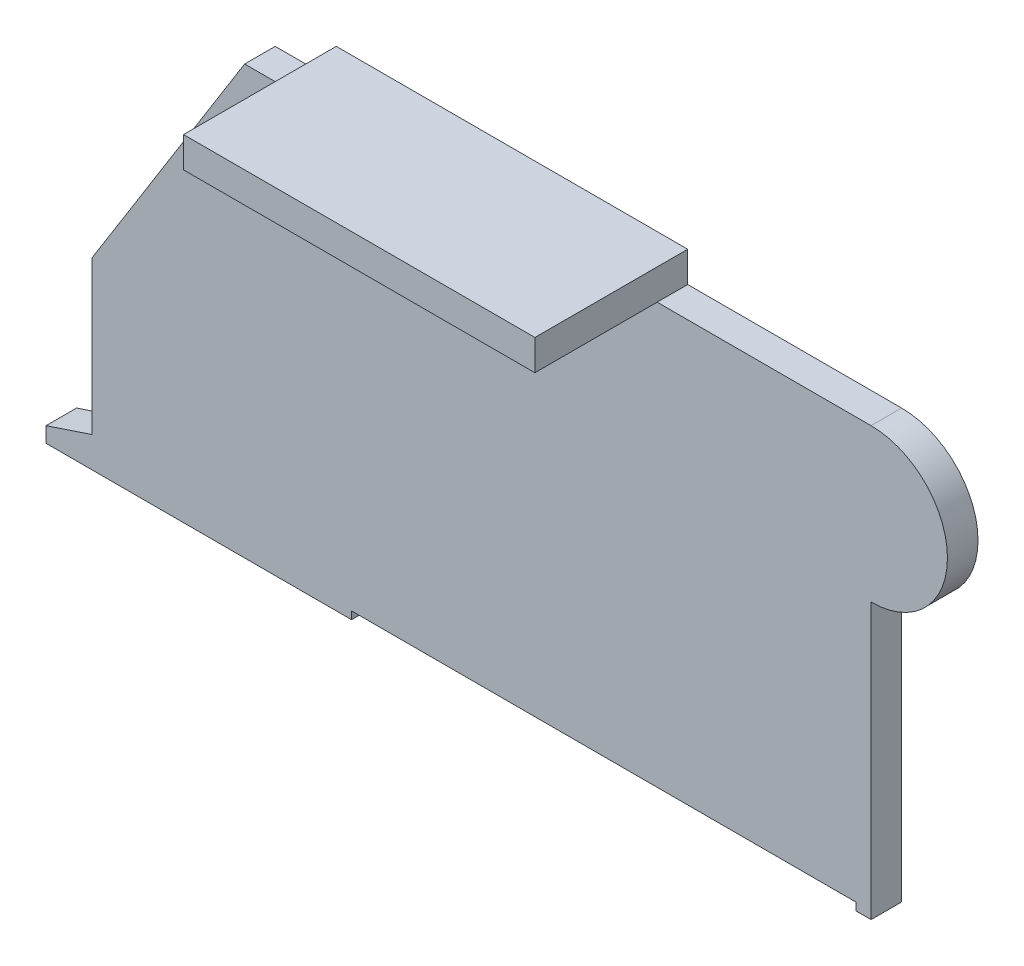
ISO-10303-21;
HEADER;
FILE_DESCRIPTION(('STEP AP214'),'2;1');
FILE_NAME('part.step','',(''),(''),'','','');
FILE_SCHEMA(('AUTOMOTIVE_DESIGN { 1 0 10303 214 1 1 1 1 }'));
ENDSEC;
DATA;
#1=APPLICATION_CONTEXT('core data for automotive mechanical design processes');
#2=APPLICATION_PROTOCOL_DEFINITION('international standard','automotive_design',2000,#1);
#3=PRODUCT_CONTEXT('',#1,'mechanical');
#4=PRODUCT('Part','Part','',(#3));
#5=PRODUCT_RELATED_PRODUCT_CATEGORY('part','',(#4));
#6=PRODUCT_DEFINITION_FORMATION('','',#4);
#7=PRODUCT_DEFINITION_CONTEXT('part definition',#1,'design');
#8=PRODUCT_DEFINITION('design','',#6,#7);
#9=PRODUCT_DEFINITION_SHAPE('','',#8);
#10=(LENGTH_UNIT() NAMED_UNIT(*) SI_UNIT(.MILLI.,.METRE.));
#11=(NAMED_UNIT(*) PLANE_ANGLE_UNIT() SI_UNIT($,.RADIAN.));
#12=(NAMED_UNIT(*) SI_UNIT($,.STERADIAN.) SOLID_ANGLE_UNIT());
#13=UNCERTAINTY_MEASURE_WITH_UNIT(LENGTH_MEASURE(1.E-05),#10,'distance_accuracy_value','');
#14=(GEOMETRIC_REPRESENTATION_CONTEXT(3) GLOBAL_UNCERTAINTY_ASSIGNED_CONTEXT((#13)) GLOBAL_UNIT_ASSIGNED_CONTEXT((#10,
#11,#12)) REPRESENTATION_CONTEXT('',''));
#15=CARTESIAN_POINT('',(0.,0.,0.));
#16=DIRECTION('',(0.,0.,1.));
#17=DIRECTION('',(1.,0.,0.));
#18=AXIS2_PLACEMENT_3D('',#15,#16,#17);
#19=CARTESIAN_POINT('',(0.,0.,2.));
#20=DIRECTION('',(0.,-1.,0.));
#21=DIRECTION('',(0.,0.,1.));
#22=AXIS2_PLACEMENT_3D('',#19,#20,#21);
#23=PLANE('',#22);
#24=DIRECTION('',(1.,0.,0.));
#25=VECTOR('',#24,1.);
#26=CARTESIAN_POINT('',(0.,0.,2.));
#27=LINE('',#26,#25);
#28=CARTESIAN_POINT('',(0.,0.,2.));
#29=VERTEX_POINT('',#28);
#30=CARTESIAN_POINT('',(20.,0.,2.));
#31=VERTEX_POINT('',#30);
#32=EDGE_CURVE('E286',#29,#31,#27,.T.);
#33=ORIENTED_EDGE('',*,*,#32,.F.);
#34=DIRECTION('',(0.,0.,-1.));
#35=VECTOR('',#34,1.);
#36=CARTESIAN_POINT('',(0.,0.,2.));
#37=LINE('',#36,#35);
#38=CARTESIAN_POINT('',(0.,0.,0.));
#39=VERTEX_POINT('',#38);
#40=EDGE_CURVE('E315',#29,#39,#37,.T.);
#41=ORIENTED_EDGE('',*,*,#40,.T.);
#42=DIRECTION('',(1.,0.,0.));
#43=VECTOR('',#42,1.);
#44=CARTESIAN_POINT('',(0.,0.,0.));
#45=LINE('',#44,#43);
#46=CARTESIAN_POINT('',(20.,0.,0.));
#47=VERTEX_POINT('',#46);
#48=EDGE_CURVE('E288',#39,#47,#45,.T.);
#49=ORIENTED_EDGE('',*,*,#48,.T.);
#50=DIRECTION('',(0.,0.,-1.));
#51=VECTOR('',#50,1.);
#52=CARTESIAN_POINT('',(20.,0.,0.5));
#53=LINE('',#52,#51);
#54=EDGE_CURVE('E272',#31,#47,#53,.T.);
#55=ORIENTED_EDGE('',*,*,#54,.F.);
#56=EDGE_LOOP('',(#33,#41,#49,#55));
#57=FACE_BOUND('',#56,.T.);
#58=ADVANCED_FACE('F41',(#57),#23,.T.);
#59=CARTESIAN_POINT('',(54.,28.,2.));
#60=DIRECTION('',(0.,1.,0.));
#61=DIRECTION('',(-1.,0.,0.));
#62=AXIS2_PLACEMENT_3D('',#59,#60,#61);
#63=PLANE('',#62);
#64=DIRECTION('',(-1.,0.,0.));
#65=VECTOR('',#64,1.);
#66=CARTESIAN_POINT('',(54.,28.,0.));
#67=LINE('',#66,#65);
#68=CARTESIAN_POINT('',(17.,28.,0.));
#69=VERTEX_POINT('',#68);
#70=CARTESIAN_POINT('',(13.,28.,0.));
#71=VERTEX_POINT('',#70);
#72=EDGE_CURVE('E325',#69,#71,#67,.T.);
#73=ORIENTED_EDGE('',*,*,#72,.T.);
#74=DIRECTION('',(0.,0.,-1.));
#75=VECTOR('',#74,1.);
#76=CARTESIAN_POINT('',(13.,28.,2.));
#77=LINE('',#76,#75);
#78=CARTESIAN_POINT('',(13.,28.,2.));
#79=VERTEX_POINT('',#78);
#80=EDGE_CURVE('E343',#79,#71,#77,.T.);
#81=ORIENTED_EDGE('',*,*,#80,.F.);
#82=DIRECTION('',(-1.,0.,0.));
#83=VECTOR('',#82,1.);
#84=CARTESIAN_POINT('',(54.,28.,2.));
#85=LINE('',#84,#83);
#86=CARTESIAN_POINT('',(17.,28.,2.));
#87=VERTEX_POINT('',#86);
#88=EDGE_CURVE('E305',#87,#79,#85,.T.);
#89=ORIENTED_EDGE('',*,*,#88,.F.);
#90=DIRECTION('',(0.,0.,-1.));
#91=VECTOR('',#90,1.);
#92=CARTESIAN_POINT('',(17.,28.,0.));
#93=LINE('',#92,#91);
#94=EDGE_CURVE('E461',#87,#69,#93,.T.);
#95=ORIENTED_EDGE('',*,*,#94,.T.);
#96=EDGE_LOOP('',(#73,#81,#89,#95));
#97=FACE_BOUND('',#96,.T.);
#98=ADVANCED_FACE('F555',(#97),#63,.T.);
#99=CARTESIAN_POINT('',(54.,28.,2.));
#100=VERTEX_POINT('',#99);
#101=CARTESIAN_POINT('',(40.,28.,2.));
#102=VERTEX_POINT('',#101);
#103=EDGE_CURVE('E306',#100,#102,#85,.T.);
#104=ORIENTED_EDGE('',*,*,#103,.F.);
#105=DIRECTION('',(0.,0.,-1.));
#106=VECTOR('',#105,1.);
#107=CARTESIAN_POINT('',(54.,28.,2.));
#108=LINE('',#107,#106);
#109=CARTESIAN_POINT('',(54.,28.,0.));
#110=VERTEX_POINT('',#109);
#111=EDGE_CURVE('E346',#100,#110,#108,.T.);
#112=ORIENTED_EDGE('',*,*,#111,.T.);
#113=CARTESIAN_POINT('',(40.,28.,0.));
#114=VERTEX_POINT('',#113);
#115=EDGE_CURVE('E326',#110,#114,#67,.T.);
#116=ORIENTED_EDGE('',*,*,#115,.T.);
#117=DIRECTION('',(0.,0.,1.));
#118=VECTOR('',#117,1.);
#119=CARTESIAN_POINT('',(40.,28.,0.));
#120=LINE('',#119,#118);
#121=EDGE_CURVE('E502',#114,#102,#120,.T.);
#122=ORIENTED_EDGE('',*,*,#121,.T.);
#123=EDGE_LOOP('',(#104,#112,#116,#122));
#124=FACE_BOUND('',#123,.T.);
#125=ADVANCED_FACE('F524',(#124),#63,.T.);
#126=CARTESIAN_POINT('',(0.,0.,2.));
#127=DIRECTION('',(-1.,0.,0.));
#128=DIRECTION('',(0.,0.,-1.));
#129=AXIS2_PLACEMENT_3D('',#126,#127,#128);
#130=PLANE('',#129);
#131=DIRECTION('',(0.,-1.,0.));
#132=VECTOR('',#131,1.);
#133=CARTESIAN_POINT('',(0.,0.,0.));
#134=LINE('',#133,#132);
#135=CARTESIAN_POINT('',(0.,1.,0.));
#136=VERTEX_POINT('',#135);
#137=EDGE_CURVE('E316',#136,#39,#134,.T.);
#138=ORIENTED_EDGE('',*,*,#137,.T.);
#139=ORIENTED_EDGE('',*,*,#40,.F.);
#140=DIRECTION('',(0.,-1.,0.));
#141=VECTOR('',#140,1.);
#142=CARTESIAN_POINT('',(0.,0.,2.));
#143=LINE('',#142,#141);
#144=CARTESIAN_POINT('',(0.,1.,2.));
#145=VERTEX_POINT('',#144);
#146=EDGE_CURVE('E294',#145,#29,#143,.T.);
#147=ORIENTED_EDGE('',*,*,#146,.F.);
#148=DIRECTION('',(0.,0.,-1.));
#149=VECTOR('',#148,1.);
#150=CARTESIAN_POINT('',(0.,1.,2.));
#151=LINE('',#150,#149);
#152=EDGE_CURVE('E49',#145,#136,#151,.T.);
#153=ORIENTED_EDGE('',*,*,#152,.T.);
#154=EDGE_LOOP('',(#138,#139,#147,#153));
#155=FACE_BOUND('',#154,.T.);
#156=ADVANCED_FACE('F43',(#155),#130,.T.);
#157=CARTESIAN_POINT('',(0.,1.,2.));
#158=DIRECTION('',(-0.316227766016838,0.948683298050514,0.));
#159=DIRECTION('',(-0.948683298050514,-0.316227766016838,0.));
#160=AXIS2_PLACEMENT_3D('',#157,#158,#159);
#161=PLANE('',#160);
#162=DIRECTION('',(-0.948683298050514,-0.316227766016838,0.));
#163=VECTOR('',#162,1.);
#164=CARTESIAN_POINT('',(0.,1.,0.));
#165=LINE('',#164,#163);
#166=CARTESIAN_POINT('',(3.,2.,0.));
#167=VERTEX_POINT('',#166);
#168=EDGE_CURVE('E333',#167,#136,#165,.T.);
#169=ORIENTED_EDGE('',*,*,#168,.T.);
#170=ORIENTED_EDGE('',*,*,#152,.F.);
#171=DIRECTION('',(-0.948683298050514,-0.316227766016838,0.));
#172=VECTOR('',#171,1.);
#173=CARTESIAN_POINT('',(0.,1.,2.));
#174=LINE('',#173,#172);
#175=CARTESIAN_POINT('',(3.,2.,2.));
#176=VERTEX_POINT('',#175);
#177=EDGE_CURVE('E313',#176,#145,#174,.T.);
#178=ORIENTED_EDGE('',*,*,#177,.F.);
#179=DIRECTION('',(0.,0.,-1.));
#180=VECTOR('',#179,1.);
#181=CARTESIAN_POINT('',(3.,2.,2.));
#182=LINE('',#181,#180);
#183=EDGE_CURVE('E337',#176,#167,#182,.T.);
#184=ORIENTED_EDGE('',*,*,#183,.T.);
#185=EDGE_LOOP('',(#169,#170,#178,#184));
#186=FACE_BOUND('',#185,.T.);
#187=ADVANCED_FACE('F566',(#186),#161,.T.);
#188=CARTESIAN_POINT('',(3.,2.,2.));
#189=DIRECTION('',(-1.,0.,0.));
#190=DIRECTION('',(0.,0.,-1.));
#191=AXIS2_PLACEMENT_3D('',#188,#189,#190);
#192=PLANE('',#191);
#193=DIRECTION('',(0.,-1.,0.));
#194=VECTOR('',#193,1.);
#195=CARTESIAN_POINT('',(3.,2.,0.));
#196=LINE('',#195,#194);
#197=CARTESIAN_POINT('',(3.,12.,0.));
#198=VERTEX_POINT('',#197);
#199=EDGE_CURVE('E331',#198,#167,#196,.T.);
#200=ORIENTED_EDGE('',*,*,#199,.T.);
#201=ORIENTED_EDGE('',*,*,#183,.F.);
#202=DIRECTION('',(0.,-1.,0.));
#203=VECTOR('',#202,1.);
#204=CARTESIAN_POINT('',(3.,2.,2.));
#205=LINE('',#204,#203);
#206=CARTESIAN_POINT('',(3.,12.,2.));
#207=VERTEX_POINT('',#206);
#208=EDGE_CURVE('E311',#207,#176,#205,.T.);
#209=ORIENTED_EDGE('',*,*,#208,.F.);
#210=DIRECTION('',(0.,0.,-1.));
#211=VECTOR('',#210,1.);
#212=CARTESIAN_POINT('',(3.,12.,2.));
#213=LINE('',#212,#211);
#214=EDGE_CURVE('E340',#207,#198,#213,.T.);
#215=ORIENTED_EDGE('',*,*,#214,.T.);
#216=EDGE_LOOP('',(#200,#201,#209,#215));
#217=FACE_BOUND('',#216,.T.);
#218=ADVANCED_FACE('F563',(#217),#192,.T.);
#219=CARTESIAN_POINT('',(3.,12.,2.));
#220=DIRECTION('',(-0.847998304005088,0.52999894000318,0.));
#221=DIRECTION('',(-0.52999894000318,-0.847998304005088,0.));
#222=AXIS2_PLACEMENT_3D('',#219,#220,#221);
#223=PLANE('',#222);
#224=DIRECTION('',(-0.52999894000318,-0.847998304005088,0.));
#225=VECTOR('',#224,1.);
#226=CARTESIAN_POINT('',(3.,12.,0.));
#227=LINE('',#226,#225);
#228=EDGE_CURVE('E329',#71,#198,#227,.T.);
#229=ORIENTED_EDGE('',*,*,#228,.T.);
#230=ORIENTED_EDGE('',*,*,#214,.F.);
#231=DIRECTION('',(-0.52999894000318,-0.847998304005088,0.));
#232=VECTOR('',#231,1.);
#233=CARTESIAN_POINT('',(3.,12.,2.));
#234=LINE('',#233,#232);
#235=EDGE_CURVE('E309',#79,#207,#234,.T.);
#236=ORIENTED_EDGE('',*,*,#235,.F.);
#237=ORIENTED_EDGE('',*,*,#80,.T.);
#238=EDGE_LOOP('',(#229,#230,#236,#237));
#239=FACE_BOUND('',#238,.T.);
#240=ADVANCED_FACE('F560',(#239),#223,.T.);
#241=CARTESIAN_POINT('',(54.,23.,2.));
#242=DIRECTION('',(0.,0.,-1.));
#243=DIRECTION('',(1.,0.,0.));
#244=AXIS2_PLACEMENT_3D('',#241,#242,#243);
#245=CYLINDRICAL_SURFACE('',#244,5.);
#246=CARTESIAN_POINT('',(54.,23.,0.));
#247=DIRECTION('',(0.,0.,1.));
#248=DIRECTION('',(1.,0.,0.));
#249=AXIS2_PLACEMENT_3D('',#246,#247,#248);
#250=CIRCLE('',#249,5.);
#251=CARTESIAN_POINT('',(54.,18.,0.));
#252=VERTEX_POINT('',#251);
#253=EDGE_CURVE('E323',#252,#110,#250,.T.);
#254=ORIENTED_EDGE('',*,*,#253,.T.);
#255=ORIENTED_EDGE('',*,*,#111,.F.);
#256=CARTESIAN_POINT('',(54.,23.,2.));
#257=DIRECTION('',(0.,0.,1.));
#258=DIRECTION('',(1.,0.,0.));
#259=AXIS2_PLACEMENT_3D('',#256,#257,#258);
#260=CIRCLE('',#259,5.);
#261=CARTESIAN_POINT('',(54.,18.,2.));
#262=VERTEX_POINT('',#261);
#263=EDGE_CURVE('E299',#262,#100,#260,.T.);
#264=ORIENTED_EDGE('',*,*,#263,.F.);
#265=DIRECTION('',(0.,0.,-1.));
#266=VECTOR('',#265,1.);
#267=CARTESIAN_POINT('',(54.,18.,2.));
#268=LINE('',#267,#266);
#269=EDGE_CURVE('E349',#262,#252,#268,.T.);
#270=ORIENTED_EDGE('',*,*,#269,.T.);
#271=EDGE_LOOP('',(#254,#255,#264,#270));
#272=FACE_BOUND('',#271,.T.);
#273=ADVANCED_FACE('F533',(#272),#245,.T.);
#274=CARTESIAN_POINT('',(54.,0.,2.));
#275=DIRECTION('',(1.,0.,0.));
#276=DIRECTION('',(0.,0.,1.));
#277=AXIS2_PLACEMENT_3D('',#274,#275,#276);
#278=PLANE('',#277);
#279=DIRECTION('',(0.,1.,0.));
#280=VECTOR('',#279,1.);
#281=CARTESIAN_POINT('',(54.,0.,0.));
#282=LINE('',#281,#280);
#283=CARTESIAN_POINT('',(54.,0.,0.));
#284=VERTEX_POINT('',#283);
#285=EDGE_CURVE('E321',#284,#252,#282,.T.);
#286=ORIENTED_EDGE('',*,*,#285,.T.);
#287=ORIENTED_EDGE('',*,*,#269,.F.);
#288=DIRECTION('',(0.,1.,0.));
#289=VECTOR('',#288,1.);
#290=CARTESIAN_POINT('',(54.,0.,2.));
#291=LINE('',#290,#289);
#292=CARTESIAN_POINT('',(54.,0.,2.));
#293=VERTEX_POINT('',#292);
#294=EDGE_CURVE('E296',#293,#262,#291,.T.);
#295=ORIENTED_EDGE('',*,*,#294,.F.);
#296=DIRECTION('',(0.,0.,-1.));
#297=VECTOR('',#296,1.);
#298=CARTESIAN_POINT('',(54.,0.,2.));
#299=LINE('',#298,#297);
#300=EDGE_CURVE('E352',#293,#284,#299,.T.);
#301=ORIENTED_EDGE('',*,*,#300,.T.);
#302=EDGE_LOOP('',(#286,#287,#295,#301));
#303=FACE_BOUND('',#302,.T.);
#304=ADVANCED_FACE('F583',(#303),#278,.T.);
#305=DIRECTION('',(0.,0.,-1.));
#306=VECTOR('',#305,1.);
#307=CARTESIAN_POINT('',(53.,0.,0.6));
#308=LINE('',#307,#306);
#309=CARTESIAN_POINT('',(53.,0.,2.));
#310=VERTEX_POINT('',#309);
#311=CARTESIAN_POINT('',(53.,0.,0.));
#312=VERTEX_POINT('',#311);
#313=EDGE_CURVE('E450',#310,#312,#308,.T.);
#314=ORIENTED_EDGE('',*,*,#313,.T.);
#315=EDGE_CURVE('E318',#312,#284,#45,.T.);
#316=ORIENTED_EDGE('',*,*,#315,.T.);
#317=ORIENTED_EDGE('',*,*,#300,.F.);
#318=EDGE_CURVE('E297',#310,#293,#27,.T.);
#319=ORIENTED_EDGE('',*,*,#318,.F.);
#320=EDGE_LOOP('',(#314,#316,#317,#319));
#321=FACE_BOUND('',#320,.T.);
#322=ADVANCED_FACE('F576',(#321),#23,.T.);
#323=CARTESIAN_POINT('',(54.,23.,2.));
#324=DIRECTION('',(0.,0.,-1.));
#325=DIRECTION('',(1.,0.,0.));
#326=AXIS2_PLACEMENT_3D('',#323,#324,#325);
#327=PLANE('',#326);
#328=DIRECTION('',(-1.,0.,0.));
#329=VECTOR('',#328,1.);
#330=CARTESIAN_POINT('',(54.,0.5,2.));
#331=LINE('',#330,#329);
#332=CARTESIAN_POINT('',(53.,0.5,2.));
#333=VERTEX_POINT('',#332);
#334=CARTESIAN_POINT('',(20.,0.5,2.));
#335=VERTEX_POINT('',#334);
#336=EDGE_CURVE('E281',#333,#335,#331,.T.);
#337=ORIENTED_EDGE('',*,*,#336,.F.);
#338=DIRECTION('',(0.,1.,0.));
#339=VECTOR('',#338,1.);
#340=CARTESIAN_POINT('',(53.0000000000003,23.,2.));
#341=LINE('',#340,#339);
#342=EDGE_CURVE('E280',#310,#333,#341,.T.);
#343=ORIENTED_EDGE('',*,*,#342,.F.);
#344=ORIENTED_EDGE('',*,*,#318,.T.);
#345=ORIENTED_EDGE('',*,*,#294,.T.);
#346=ORIENTED_EDGE('',*,*,#263,.T.);
#347=ORIENTED_EDGE('',*,*,#103,.T.);
#348=DIRECTION('',(1.,0.,0.));
#349=VECTOR('',#348,1.);
#350=CARTESIAN_POINT('',(54.,28.,2.));
#351=LINE('',#350,#349);
#352=EDGE_CURVE('E319',#87,#102,#351,.T.);
#353=ORIENTED_EDGE('',*,*,#352,.F.);
#354=ORIENTED_EDGE('',*,*,#88,.T.);
#355=ORIENTED_EDGE('',*,*,#235,.T.);
#356=ORIENTED_EDGE('',*,*,#208,.T.);
#357=ORIENTED_EDGE('',*,*,#177,.T.);
#358=ORIENTED_EDGE('',*,*,#146,.T.);
#359=ORIENTED_EDGE('',*,*,#32,.T.);
#360=DIRECTION('',(0.,-1.,0.));
#361=VECTOR('',#360,1.);
#362=CARTESIAN_POINT('',(20.,23.,2.));
#363=LINE('',#362,#361);
#364=EDGE_CURVE('E268',#335,#31,#363,.T.);
#365=ORIENTED_EDGE('',*,*,#364,.F.);
#366=EDGE_LOOP('',(#337,#343,#344,#345,#346,#347,#353,#354,#355,#356,#357,#358,#359,#365));
#367=FACE_BOUND('',#366,.T.);
#368=ADVANCED_FACE('F292',(#367),#327,.F.);
#369=CARTESIAN_POINT('',(54.,23.,0.));
#370=DIRECTION('',(0.,0.,-1.));
#371=DIRECTION('',(1.,0.,0.));
#372=AXIS2_PLACEMENT_3D('',#369,#370,#371);
#373=PLANE('',#372);
#374=DIRECTION('',(-1.,0.,0.));
#375=VECTOR('',#374,1.);
#376=CARTESIAN_POINT('',(20.,0.5,0.));
#377=LINE('',#376,#375);
#378=CARTESIAN_POINT('',(45.,0.5,0.));
#379=VERTEX_POINT('',#378);
#380=CARTESIAN_POINT('',(33.,0.5,0.));
#381=VERTEX_POINT('',#380);
#382=EDGE_CURVE('E966',#379,#381,#377,.T.);
#383=ORIENTED_EDGE('',*,*,#382,.T.);
#384=DIRECTION('',(0.,1.,0.));
#385=VECTOR('',#384,1.);
#386=CARTESIAN_POINT('',(33.,0.,0.));
#387=LINE('',#386,#385);
#388=CARTESIAN_POINT('',(33.,4.,0.));
#389=VERTEX_POINT('',#388);
#390=EDGE_CURVE('E418',#381,#389,#387,.T.);
#391=ORIENTED_EDGE('',*,*,#390,.T.);
#392=DIRECTION('',(-1.,0.,0.));
#393=VECTOR('',#392,1.);
#394=CARTESIAN_POINT('',(25.,4.,0.));
#395=LINE('',#394,#393);
#396=CARTESIAN_POINT('',(25.,4.,0.));
#397=VERTEX_POINT('',#396);
#398=EDGE_CURVE('E414',#389,#397,#395,.T.);
#399=ORIENTED_EDGE('',*,*,#398,.T.);
#400=DIRECTION('',(0.,-1.,0.));
#401=VECTOR('',#400,1.);
#402=CARTESIAN_POINT('',(25.,0.,0.));
#403=LINE('',#402,#401);
#404=CARTESIAN_POINT('',(25.,0.5,0.));
#405=VERTEX_POINT('',#404);
#406=EDGE_CURVE('E399',#397,#405,#403,.T.);
#407=ORIENTED_EDGE('',*,*,#406,.T.);
#408=CARTESIAN_POINT('',(24.,0.5,0.));
#409=VERTEX_POINT('',#408);
#410=EDGE_CURVE('E631',#405,#409,#377,.T.);
#411=ORIENTED_EDGE('',*,*,#410,.T.);
#412=DIRECTION('',(0.,1.,0.));
#413=VECTOR('',#412,1.);
#414=CARTESIAN_POINT('',(24.,0.,0.));
#415=LINE('',#414,#413);
#416=CARTESIAN_POINT('',(24.,10.,0.));
#417=VERTEX_POINT('',#416);
#418=EDGE_CURVE('E371',#409,#417,#415,.T.);
#419=ORIENTED_EDGE('',*,*,#418,.T.);
#420=DIRECTION('',(-1.,0.,0.));
#421=VECTOR('',#420,1.);
#422=CARTESIAN_POINT('',(24.,10.,0.));
#423=LINE('',#422,#421);
#424=CARTESIAN_POINT('',(20.,10.,0.));
#425=VERTEX_POINT('',#424);
#426=EDGE_CURVE('E365',#417,#425,#423,.T.);
#427=ORIENTED_EDGE('',*,*,#426,.T.);
#428=DIRECTION('',(0.,-1.,0.));
#429=VECTOR('',#428,1.);
#430=CARTESIAN_POINT('',(20.,0.,0.));
#431=LINE('',#430,#429);
#432=EDGE_CURVE('E363',#425,#47,#431,.T.);
#433=ORIENTED_EDGE('',*,*,#432,.T.);
#434=ORIENTED_EDGE('',*,*,#48,.F.);
#435=ORIENTED_EDGE('',*,*,#137,.F.);
#436=ORIENTED_EDGE('',*,*,#168,.F.);
#437=ORIENTED_EDGE('',*,*,#199,.F.);
#438=ORIENTED_EDGE('',*,*,#228,.F.);
#439=ORIENTED_EDGE('',*,*,#72,.F.);
#440=DIRECTION('',(0.,-1.,0.));
#441=VECTOR('',#440,1.);
#442=CARTESIAN_POINT('',(17.,30.,0.));
#443=LINE('',#442,#441);
#444=CARTESIAN_POINT('',(17.,30.,0.));
#445=VERTEX_POINT('',#444);
#446=EDGE_CURVE('E512',#445,#69,#443,.T.);
#447=ORIENTED_EDGE('',*,*,#446,.F.);
#448=DIRECTION('',(1.,0.,0.));
#449=VECTOR('',#448,1.);
#450=CARTESIAN_POINT('',(17.,30.,0.));
#451=LINE('',#450,#449);
#452=CARTESIAN_POINT('',(40.,30.,0.));
#453=VERTEX_POINT('',#452);
#454=EDGE_CURVE('E489',#445,#453,#451,.T.);
#455=ORIENTED_EDGE('',*,*,#454,.T.);
#456=DIRECTION('',(0.,-1.,0.));
#457=VECTOR('',#456,1.);
#458=CARTESIAN_POINT('',(40.,30.,0.));
#459=LINE('',#458,#457);
#460=EDGE_CURVE('E510',#453,#114,#459,.T.);
#461=ORIENTED_EDGE('',*,*,#460,.T.);
#462=ORIENTED_EDGE('',*,*,#115,.F.);
#463=ORIENTED_EDGE('',*,*,#253,.F.);
#464=ORIENTED_EDGE('',*,*,#285,.F.);
#465=ORIENTED_EDGE('',*,*,#315,.F.);
#466=DIRECTION('',(0.,1.,0.));
#467=VECTOR('',#466,1.);
#468=CARTESIAN_POINT('',(53.,0.,0.));
#469=LINE('',#468,#467);
#470=CARTESIAN_POINT('',(53.,4.,0.));
#471=VERTEX_POINT('',#470);
#472=EDGE_CURVE('E425',#312,#471,#469,.T.);
#473=ORIENTED_EDGE('',*,*,#472,.T.);
#474=DIRECTION('',(-1.,0.,0.));
#475=VECTOR('',#474,1.);
#476=CARTESIAN_POINT('',(45.,4.,0.));
#477=LINE('',#476,#475);
#478=CARTESIAN_POINT('',(45.,4.,0.));
#479=VERTEX_POINT('',#478);
#480=EDGE_CURVE('E428',#471,#479,#477,.T.);
#481=ORIENTED_EDGE('',*,*,#480,.T.);
#482=DIRECTION('',(0.,-1.,0.));
#483=VECTOR('',#482,1.);
#484=CARTESIAN_POINT('',(45.,0.,0.));
#485=LINE('',#484,#483);
#486=EDGE_CURVE('E411',#479,#379,#485,.T.);
#487=ORIENTED_EDGE('',*,*,#486,.T.);
#488=EDGE_LOOP('',(#383,#391,#399,#407,#411,#419,#427,#433,#434,#435,#436,#437,#438,#439,#447,
#455,#461,#462,#463,#464,#465,#473,#481,#487));
#489=FACE_BOUND('',#488,.T.);
#490=DIRECTION('',(0.,-1.,0.));
#491=VECTOR('',#490,1.);
#492=CARTESIAN_POINT('',(45.,10.,0.));
#493=LINE('',#492,#491);
#494=CARTESIAN_POINT('',(45.,10.,0.));
#495=VERTEX_POINT('',#494);
#496=CARTESIAN_POINT('',(45.,6.,0.));
#497=VERTEX_POINT('',#496);
#498=EDGE_CURVE('E408',#495,#497,#493,.T.);
#499=ORIENTED_EDGE('',*,*,#498,.T.);
#500=DIRECTION('',(1.,0.,0.));
#501=VECTOR('',#500,1.);
#502=CARTESIAN_POINT('',(45.,6.,0.));
#503=LINE('',#502,#501);
#504=CARTESIAN_POINT('',(53.,6.,0.));
#505=VERTEX_POINT('',#504);
#506=EDGE_CURVE('E405',#497,#505,#503,.T.);
#507=ORIENTED_EDGE('',*,*,#506,.T.);
#508=DIRECTION('',(0.,1.,0.));
#509=VECTOR('',#508,1.);
#510=CARTESIAN_POINT('',(53.,10.,0.));
#511=LINE('',#510,#509);
#512=CARTESIAN_POINT('',(53.,10.,0.));
#513=VERTEX_POINT('',#512);
#514=EDGE_CURVE('E402',#505,#513,#511,.T.);
#515=ORIENTED_EDGE('',*,*,#514,.T.);
#516=DIRECTION('',(-1.,0.,0.));
#517=VECTOR('',#516,1.);
#518=CARTESIAN_POINT('',(45.,10.,0.));
#519=LINE('',#518,#517);
#520=EDGE_CURVE('E396',#513,#495,#519,.T.);
#521=ORIENTED_EDGE('',*,*,#520,.T.);
#522=EDGE_LOOP('',(#499,#507,#515,#521));
#523=FACE_BOUND('',#522,.T.);
#524=DIRECTION('',(0.,-1.,0.));
#525=VECTOR('',#524,1.);
#526=CARTESIAN_POINT('',(25.,10.,0.));
#527=LINE('',#526,#525);
#528=CARTESIAN_POINT('',(25.,10.,0.));
#529=VERTEX_POINT('',#528);
#530=CARTESIAN_POINT('',(25.,6.,0.));
#531=VERTEX_POINT('',#530);
#532=EDGE_CURVE('E390',#529,#531,#527,.T.);
#533=ORIENTED_EDGE('',*,*,#532,.T.);
#534=DIRECTION('',(1.,0.,0.));
#535=VECTOR('',#534,1.);
#536=CARTESIAN_POINT('',(25.,6.,0.));
#537=LINE('',#536,#535);
#538=CARTESIAN_POINT('',(33.,6.,0.));
#539=VERTEX_POINT('',#538);
#540=EDGE_CURVE('E387',#531,#539,#537,.T.);
#541=ORIENTED_EDGE('',*,*,#540,.T.);
#542=DIRECTION('',(0.,1.,0.));
#543=VECTOR('',#542,1.);
#544=CARTESIAN_POINT('',(33.,10.,0.));
#545=LINE('',#544,#543);
#546=CARTESIAN_POINT('',(33.,10.,0.));
#547=VERTEX_POINT('',#546);
#548=EDGE_CURVE('E384',#539,#547,#545,.T.);
#549=ORIENTED_EDGE('',*,*,#548,.T.);
#550=DIRECTION('',(-1.,0.,0.));
#551=VECTOR('',#550,1.);
#552=CARTESIAN_POINT('',(25.,10.,0.));
#553=LINE('',#552,#551);
#554=EDGE_CURVE('E380',#547,#529,#553,.T.);
#555=ORIENTED_EDGE('',*,*,#554,.T.);
#556=EDGE_LOOP('',(#533,#541,#549,#555));
#557=FACE_BOUND('',#556,.T.);
#558=ADVANCED_FACE('F360',(#489,#523,#557),#373,.T.);
#559=CARTESIAN_POINT('',(0.,28.,0.));
#560=DIRECTION('',(0.,-1.,0.));
#561=DIRECTION('',(1.,0.,0.));
#562=AXIS2_PLACEMENT_3D('',#559,#560,#561);
#563=PLANE('',#562);
#564=ORIENTED_EDGE('',*,*,#352,.T.);
#565=CARTESIAN_POINT('',(40.,28.,10.));
#566=VERTEX_POINT('',#565);
#567=EDGE_CURVE('E501',#102,#566,#120,.T.);
#568=ORIENTED_EDGE('',*,*,#567,.T.);
#569=DIRECTION('',(-1.,0.,0.));
#570=VECTOR('',#569,1.);
#571=CARTESIAN_POINT('',(17.,28.,10.));
#572=LINE('',#571,#570);
#573=CARTESIAN_POINT('',(17.,28.,10.));
#574=VERTEX_POINT('',#573);
#575=EDGE_CURVE('E490',#566,#574,#572,.T.);
#576=ORIENTED_EDGE('',*,*,#575,.T.);
#577=EDGE_CURVE('E499',#574,#87,#93,.T.);
#578=ORIENTED_EDGE('',*,*,#577,.T.);
#579=EDGE_LOOP('',(#564,#568,#576,#578));
#580=FACE_BOUND('',#579,.T.);
#581=ADVANCED_FACE('F517',(#580),#563,.T.);
#582=CARTESIAN_POINT('',(17.,30.,0.));
#583=DIRECTION('',(1.,0.,0.));
#584=DIRECTION('',(0.,1.,0.));
#585=AXIS2_PLACEMENT_3D('',#582,#583,#584);
#586=PLANE('',#585);
#587=ORIENTED_EDGE('',*,*,#577,.F.);
#588=DIRECTION('',(0.,-1.,0.));
#589=VECTOR('',#588,1.);
#590=CARTESIAN_POINT('',(17.,30.,10.));
#591=LINE('',#590,#589);
#592=CARTESIAN_POINT('',(17.,30.,10.));
#593=VERTEX_POINT('',#592);
#594=EDGE_CURVE('E498',#593,#574,#591,.T.);
#595=ORIENTED_EDGE('',*,*,#594,.F.);
#596=DIRECTION('',(0.,0.,-1.));
#597=VECTOR('',#596,1.);
#598=CARTESIAN_POINT('',(17.,30.,0.));
#599=LINE('',#598,#597);
#600=EDGE_CURVE('E487',#593,#445,#599,.T.);
#601=ORIENTED_EDGE('',*,*,#600,.T.);
#602=ORIENTED_EDGE('',*,*,#446,.T.);
#603=ORIENTED_EDGE('',*,*,#94,.F.);
#604=EDGE_LOOP('',(#587,#595,#601,#602,#603));
#605=FACE_BOUND('',#604,.T.);
#606=ADVANCED_FACE('F548',(#605),#586,.F.);
#607=CARTESIAN_POINT('',(40.,30.,0.));
#608=DIRECTION('',(-1.,0.,0.));
#609=DIRECTION('',(0.,-1.,0.));
#610=AXIS2_PLACEMENT_3D('',#607,#608,#609);
#611=PLANE('',#610);
#612=ORIENTED_EDGE('',*,*,#121,.F.);
#613=ORIENTED_EDGE('',*,*,#460,.F.);
#614=DIRECTION('',(0.,0.,1.));
#615=VECTOR('',#614,1.);
#616=CARTESIAN_POINT('',(40.,30.,0.));
#617=LINE('',#616,#615);
#618=CARTESIAN_POINT('',(40.,30.,10.));
#619=VERTEX_POINT('',#618);
#620=EDGE_CURVE('E493',#453,#619,#617,.T.);
#621=ORIENTED_EDGE('',*,*,#620,.T.);
#622=DIRECTION('',(0.,-1.,0.));
#623=VECTOR('',#622,1.);
#624=CARTESIAN_POINT('',(40.,30.,10.));
#625=LINE('',#624,#623);
#626=EDGE_CURVE('E508',#619,#566,#625,.T.);
#627=ORIENTED_EDGE('',*,*,#626,.T.);
#628=ORIENTED_EDGE('',*,*,#567,.F.);
#629=EDGE_LOOP('',(#612,#613,#621,#627,#628));
#630=FACE_BOUND('',#629,.T.);
#631=ADVANCED_FACE('F538',(#630),#611,.F.);
#632=CARTESIAN_POINT('',(17.,30.,10.));
#633=DIRECTION('',(0.,0.,-1.));
#634=DIRECTION('',(1.,0.,0.));
#635=AXIS2_PLACEMENT_3D('',#632,#633,#634);
#636=PLANE('',#635);
#637=ORIENTED_EDGE('',*,*,#575,.F.);
#638=ORIENTED_EDGE('',*,*,#626,.F.);
#639=DIRECTION('',(-1.,0.,0.));
#640=VECTOR('',#639,1.);
#641=CARTESIAN_POINT('',(17.,30.,10.));
#642=LINE('',#641,#640);
#643=EDGE_CURVE('E496',#619,#593,#642,.T.);
#644=ORIENTED_EDGE('',*,*,#643,.T.);
#645=ORIENTED_EDGE('',*,*,#594,.T.);
#646=EDGE_LOOP('',(#637,#638,#644,#645));
#647=FACE_BOUND('',#646,.T.);
#648=ADVANCED_FACE('F546',(#647),#636,.F.);
#649=CARTESIAN_POINT('',(0.,30.,0.));
#650=DIRECTION('',(0.,-1.,0.));
#651=DIRECTION('',(1.,0.,0.));
#652=AXIS2_PLACEMENT_3D('',#649,#650,#651);
#653=PLANE('',#652);
#654=ORIENTED_EDGE('',*,*,#600,.F.);
#655=ORIENTED_EDGE('',*,*,#643,.F.);
#656=ORIENTED_EDGE('',*,*,#620,.F.);
#657=ORIENTED_EDGE('',*,*,#454,.F.);
#658=EDGE_LOOP('',(#654,#655,#656,#657));
#659=FACE_BOUND('',#658,.T.);
#660=ADVANCED_FACE('F543',(#659),#653,.F.);
#661=CARTESIAN_POINT('',(25.,10.,0.6));
#662=DIRECTION('',(-1.,0.,0.));
#663=DIRECTION('',(0.,0.,-1.));
#664=AXIS2_PLACEMENT_3D('',#661,#662,#663);
#665=PLANE('',#664);
#666=ORIENTED_EDGE('',*,*,#406,.F.);
#667=DIRECTION('',(0.,0.,-1.));
#668=VECTOR('',#667,1.);
#669=CARTESIAN_POINT('',(25.,4.,1.));
#670=LINE('',#669,#668);
#671=CARTESIAN_POINT('',(25.,4.,0.6));
#672=VERTEX_POINT('',#671);
#673=EDGE_CURVE('E393',#672,#397,#670,.T.);
#674=ORIENTED_EDGE('',*,*,#673,.F.);
#675=DIRECTION('',(0.,-1.,0.));
#676=VECTOR('',#675,1.);
#677=CARTESIAN_POINT('',(25.,10.,0.6));
#678=LINE('',#677,#676);
#679=CARTESIAN_POINT('',(25.,6.,0.6));
#680=VERTEX_POINT('',#679);
#681=EDGE_CURVE('E445',#680,#672,#678,.T.);
#682=ORIENTED_EDGE('',*,*,#681,.F.);
#683=DIRECTION('',(0.,0.,-1.));
#684=VECTOR('',#683,1.);
#685=CARTESIAN_POINT('',(25.,6.,1.));
#686=LINE('',#685,#684);
#687=EDGE_CURVE('E378',#680,#531,#686,.T.);
#688=ORIENTED_EDGE('',*,*,#687,.T.);
#689=ORIENTED_EDGE('',*,*,#532,.F.);
#690=DIRECTION('',(0.,0.,1.));
#691=VECTOR('',#690,1.);
#692=CARTESIAN_POINT('',(25.,10.,0.6));
#693=LINE('',#692,#691);
#694=CARTESIAN_POINT('',(25.,10.,1.4));
#695=VERTEX_POINT('',#694);
#696=EDGE_CURVE('E457',#529,#695,#693,.T.);
#697=ORIENTED_EDGE('',*,*,#696,.T.);
#698=DIRECTION('',(0.,-1.,0.));
#699=VECTOR('',#698,1.);
#700=CARTESIAN_POINT('',(25.,10.,1.4));
#701=LINE('',#700,#699);
#702=CARTESIAN_POINT('',(25.,0.5,1.4));
#703=VERTEX_POINT('',#702);
#704=EDGE_CURVE('E470',#695,#703,#701,.T.);
#705=ORIENTED_EDGE('',*,*,#704,.T.);
#706=DIRECTION('',(0.,0.,1.));
#707=VECTOR('',#706,1.);
#708=CARTESIAN_POINT('',(25.,0.5,0.6));
#709=LINE('',#708,#707);
#710=EDGE_CURVE('E623',#405,#703,#709,.T.);
#711=ORIENTED_EDGE('',*,*,#710,.F.);
#712=EDGE_LOOP('',(#666,#674,#682,#688,#689,#697,#705,#711));
#713=FACE_BOUND('',#712,.T.);
#714=ADVANCED_FACE('F682',(#713),#665,.F.);
#715=CARTESIAN_POINT('',(25.,10.,0.6));
#716=DIRECTION('',(0.,0.,-1.));
#717=DIRECTION('',(1.,0.,0.));
#718=AXIS2_PLACEMENT_3D('',#715,#716,#717);
#719=PLANE('',#718);
#720=DIRECTION('',(0.,-1.,0.));
#721=VECTOR('',#720,1.);
#722=CARTESIAN_POINT('',(33.,10.,0.6));
#723=LINE('',#722,#721);
#724=CARTESIAN_POINT('',(33.,6.,0.6));
#725=VERTEX_POINT('',#724);
#726=CARTESIAN_POINT('',(33.,4.,0.6));
#727=VERTEX_POINT('',#726);
#728=EDGE_CURVE('E477',#725,#727,#723,.T.);
#729=ORIENTED_EDGE('',*,*,#728,.F.);
#730=DIRECTION('',(1.,0.,0.));
#731=VECTOR('',#730,1.);
#732=CARTESIAN_POINT('',(25.,6.,0.6));
#733=LINE('',#732,#731);
#734=EDGE_CURVE('E440',#680,#725,#733,.T.);
#735=ORIENTED_EDGE('',*,*,#734,.F.);
#736=ORIENTED_EDGE('',*,*,#681,.T.);
#737=DIRECTION('',(-1.,0.,0.));
#738=VECTOR('',#737,1.);
#739=CARTESIAN_POINT('',(25.,4.,0.6));
#740=LINE('',#739,#738);
#741=EDGE_CURVE('E443',#727,#672,#740,.T.);
#742=ORIENTED_EDGE('',*,*,#741,.F.);
#743=EDGE_LOOP('',(#729,#735,#736,#742));
#744=FACE_BOUND('',#743,.T.);
#745=ADVANCED_FACE('F685',(#744),#719,.F.);
#746=CARTESIAN_POINT('',(33.,10.,0.6));
#747=DIRECTION('',(1.,0.,0.));
#748=DIRECTION('',(0.,0.,1.));
#749=AXIS2_PLACEMENT_3D('',#746,#747,#748);
#750=PLANE('',#749);
#751=DIRECTION('',(0.,-1.,0.));
#752=VECTOR('',#751,1.);
#753=CARTESIAN_POINT('',(33.,10.,1.4));
#754=LINE('',#753,#752);
#755=CARTESIAN_POINT('',(33.,10.,1.4));
#756=VERTEX_POINT('',#755);
#757=CARTESIAN_POINT('',(33.,0.5,1.4));
#758=VERTEX_POINT('',#757);
#759=EDGE_CURVE('E474',#756,#758,#754,.T.);
#760=ORIENTED_EDGE('',*,*,#759,.F.);
#761=DIRECTION('',(0.,0.,-1.));
#762=VECTOR('',#761,1.);
#763=CARTESIAN_POINT('',(33.,10.,0.6));
#764=LINE('',#763,#762);
#765=EDGE_CURVE('E473',#756,#547,#764,.T.);
#766=ORIENTED_EDGE('',*,*,#765,.T.);
#767=ORIENTED_EDGE('',*,*,#548,.F.);
#768=DIRECTION('',(0.,0.,-1.));
#769=VECTOR('',#768,1.);
#770=CARTESIAN_POINT('',(33.,6.,1.));
#771=LINE('',#770,#769);
#772=EDGE_CURVE('E289',#725,#539,#771,.T.);
#773=ORIENTED_EDGE('',*,*,#772,.F.);
#774=ORIENTED_EDGE('',*,*,#728,.T.);
#775=DIRECTION('',(0.,0.,-1.));
#776=VECTOR('',#775,1.);
#777=CARTESIAN_POINT('',(33.,4.,1.));
#778=LINE('',#777,#776);
#779=EDGE_CURVE('E412',#727,#389,#778,.T.);
#780=ORIENTED_EDGE('',*,*,#779,.T.);
#781=ORIENTED_EDGE('',*,*,#390,.F.);
#782=DIRECTION('',(0.,0.,-1.));
#783=VECTOR('',#782,1.);
#784=CARTESIAN_POINT('',(33.,0.5,0.6));
#785=LINE('',#784,#783);
#786=EDGE_CURVE('E616',#758,#381,#785,.T.);
#787=ORIENTED_EDGE('',*,*,#786,.F.);
#788=EDGE_LOOP('',(#760,#766,#767,#773,#774,#780,#781,#787));
#789=FACE_BOUND('',#788,.T.);
#790=ADVANCED_FACE('F690',(#789),#750,.F.);
#791=CARTESIAN_POINT('',(25.,10.,1.4));
#792=DIRECTION('',(0.,0.,1.));
#793=DIRECTION('',(-1.,0.,0.));
#794=AXIS2_PLACEMENT_3D('',#791,#792,#793);
#795=PLANE('',#794);
#796=ORIENTED_EDGE('',*,*,#704,.F.);
#797=DIRECTION('',(1.,0.,0.));
#798=VECTOR('',#797,1.);
#799=CARTESIAN_POINT('',(25.,10.,1.4));
#800=LINE('',#799,#798);
#801=EDGE_CURVE('E483',#695,#756,#800,.T.);
#802=ORIENTED_EDGE('',*,*,#801,.T.);
#803=ORIENTED_EDGE('',*,*,#759,.T.);
#804=DIRECTION('',(1.,0.,0.));
#805=VECTOR('',#804,1.);
#806=CARTESIAN_POINT('',(25.,0.5,1.4));
#807=LINE('',#806,#805);
#808=EDGE_CURVE('E613',#703,#758,#807,.T.);
#809=ORIENTED_EDGE('',*,*,#808,.F.);
#810=EDGE_LOOP('',(#796,#802,#803,#809));
#811=FACE_BOUND('',#810,.T.);
#812=ADVANCED_FACE('F687',(#811),#795,.F.);
#813=CARTESIAN_POINT('',(0.,10.,0.));
#814=DIRECTION('',(0.,-1.,0.));
#815=DIRECTION('',(0.,0.,1.));
#816=AXIS2_PLACEMENT_3D('',#813,#814,#815);
#817=PLANE('',#816);
#818=ORIENTED_EDGE('',*,*,#696,.F.);
#819=ORIENTED_EDGE('',*,*,#554,.F.);
#820=ORIENTED_EDGE('',*,*,#765,.F.);
#821=ORIENTED_EDGE('',*,*,#801,.F.);
#822=EDGE_LOOP('',(#818,#819,#820,#821));
#823=FACE_BOUND('',#822,.T.);
#824=ADVANCED_FACE('F681',(#823),#817,.T.);
#825=CARTESIAN_POINT('',(45.,10.,0.6));
#826=DIRECTION('',(-1.,0.,0.));
#827=DIRECTION('',(0.,0.,-1.));
#828=AXIS2_PLACEMENT_3D('',#825,#826,#827);
#829=PLANE('',#828);
#830=ORIENTED_EDGE('',*,*,#486,.F.);
#831=DIRECTION('',(0.,0.,-1.));
#832=VECTOR('',#831,1.);
#833=CARTESIAN_POINT('',(45.,4.,1.));
#834=LINE('',#833,#832);
#835=CARTESIAN_POINT('',(45.,4.,0.6));
#836=VERTEX_POINT('',#835);
#837=EDGE_CURVE('E432',#836,#479,#834,.T.);
#838=ORIENTED_EDGE('',*,*,#837,.F.);
#839=DIRECTION('',(0.,-1.,0.));
#840=VECTOR('',#839,1.);
#841=CARTESIAN_POINT('',(45.,10.,0.6));
#842=LINE('',#841,#840);
#843=CARTESIAN_POINT('',(45.,6.,0.6));
#844=VERTEX_POINT('',#843);
#845=EDGE_CURVE('E458',#844,#836,#842,.T.);
#846=ORIENTED_EDGE('',*,*,#845,.F.);
#847=DIRECTION('',(0.,0.,-1.));
#848=VECTOR('',#847,1.);
#849=CARTESIAN_POINT('',(45.,6.,1.));
#850=LINE('',#849,#848);
#851=EDGE_CURVE('E394',#844,#497,#850,.T.);
#852=ORIENTED_EDGE('',*,*,#851,.T.);
#853=ORIENTED_EDGE('',*,*,#498,.F.);
#854=DIRECTION('',(0.,0.,1.));
#855=VECTOR('',#854,1.);
#856=CARTESIAN_POINT('',(45.,10.,0.6));
#857=LINE('',#856,#855);
#858=CARTESIAN_POINT('',(45.,10.,1.4));
#859=VERTEX_POINT('',#858);
#860=EDGE_CURVE('E446',#495,#859,#857,.T.);
#861=ORIENTED_EDGE('',*,*,#860,.T.);
#862=DIRECTION('',(0.,-1.,0.));
#863=VECTOR('',#862,1.);
#864=CARTESIAN_POINT('',(45.,10.,1.4));
#865=LINE('',#864,#863);
#866=CARTESIAN_POINT('',(45.,0.5,1.4));
#867=VERTEX_POINT('',#866);
#868=EDGE_CURVE('E454',#859,#867,#865,.T.);
#869=ORIENTED_EDGE('',*,*,#868,.T.);
#870=DIRECTION('',(0.,0.,1.));
#871=VECTOR('',#870,1.);
#872=CARTESIAN_POINT('',(45.,0.5,0.6));
#873=LINE('',#872,#871);
#874=EDGE_CURVE('E611',#379,#867,#873,.T.);
#875=ORIENTED_EDGE('',*,*,#874,.F.);
#876=EDGE_LOOP('',(#830,#838,#846,#852,#853,#861,#869,#875));
#877=FACE_BOUND('',#876,.T.);
#878=ADVANCED_FACE('F609',(#877),#829,.F.);
#879=CARTESIAN_POINT('',(45.,10.,0.6));
#880=DIRECTION('',(0.,0.,-1.));
#881=DIRECTION('',(1.,0.,0.));
#882=AXIS2_PLACEMENT_3D('',#879,#880,#881);
#883=PLANE('',#882);
#884=ORIENTED_EDGE('',*,*,#845,.T.);
#885=DIRECTION('',(-1.,0.,0.));
#886=VECTOR('',#885,1.);
#887=CARTESIAN_POINT('',(45.,4.,0.6));
#888=LINE('',#887,#886);
#889=CARTESIAN_POINT('',(53.,4.,0.6));
#890=VERTEX_POINT('',#889);
#891=EDGE_CURVE('E434',#890,#836,#888,.T.);
#892=ORIENTED_EDGE('',*,*,#891,.F.);
#893=DIRECTION('',(0.,-1.,0.));
#894=VECTOR('',#893,1.);
#895=CARTESIAN_POINT('',(53.,10.,0.6));
#896=LINE('',#895,#894);
#897=CARTESIAN_POINT('',(53.,6.,0.6));
#898=VERTEX_POINT('',#897);
#899=EDGE_CURVE('E462',#898,#890,#896,.T.);
#900=ORIENTED_EDGE('',*,*,#899,.F.);
#901=DIRECTION('',(1.,0.,0.));
#902=VECTOR('',#901,1.);
#903=CARTESIAN_POINT('',(45.,6.,0.6));
#904=LINE('',#903,#902);
#905=EDGE_CURVE('E437',#844,#898,#904,.T.);
#906=ORIENTED_EDGE('',*,*,#905,.F.);
#907=EDGE_LOOP('',(#884,#892,#900,#906));
#908=FACE_BOUND('',#907,.T.);
#909=ADVANCED_FACE('F670',(#908),#883,.F.);
#910=CARTESIAN_POINT('',(53.,10.,0.6));
#911=DIRECTION('',(1.,0.,0.));
#912=DIRECTION('',(0.,0.,1.));
#913=AXIS2_PLACEMENT_3D('',#910,#911,#912);
#914=PLANE('',#913);
#915=DIRECTION('',(0.,-1.,0.));
#916=VECTOR('',#915,1.);
#917=CARTESIAN_POINT('',(53.,10.,1.4));
#918=LINE('',#917,#916);
#919=CARTESIAN_POINT('',(53.,10.,1.4));
#920=VERTEX_POINT('',#919);
#921=CARTESIAN_POINT('',(53.,0.5,1.4));
#922=VERTEX_POINT('',#921);
#923=EDGE_CURVE('E465',#920,#922,#918,.T.);
#924=ORIENTED_EDGE('',*,*,#923,.F.);
#925=DIRECTION('',(0.,0.,-1.));
#926=VECTOR('',#925,1.);
#927=CARTESIAN_POINT('',(53.,10.,0.6));
#928=LINE('',#927,#926);
#929=EDGE_CURVE('E452',#920,#513,#928,.T.);
#930=ORIENTED_EDGE('',*,*,#929,.T.);
#931=ORIENTED_EDGE('',*,*,#514,.F.);
#932=DIRECTION('',(0.,0.,-1.));
#933=VECTOR('',#932,1.);
#934=CARTESIAN_POINT('',(53.,6.,1.));
#935=LINE('',#934,#933);
#936=EDGE_CURVE('E397',#898,#505,#935,.T.);
#937=ORIENTED_EDGE('',*,*,#936,.F.);
#938=ORIENTED_EDGE('',*,*,#899,.T.);
#939=DIRECTION('',(0.,0.,-1.));
#940=VECTOR('',#939,1.);
#941=CARTESIAN_POINT('',(53.,4.,1.));
#942=LINE('',#941,#940);
#943=EDGE_CURVE('E431',#890,#471,#942,.T.);
#944=ORIENTED_EDGE('',*,*,#943,.T.);
#945=ORIENTED_EDGE('',*,*,#472,.F.);
#946=ORIENTED_EDGE('',*,*,#313,.F.);
#947=ORIENTED_EDGE('',*,*,#342,.T.);
#948=DIRECTION('',(0.,0.,-1.));
#949=VECTOR('',#948,1.);
#950=CARTESIAN_POINT('',(53.,0.5,10.));
#951=LINE('',#950,#949);
#952=EDGE_CURVE('E965',#333,#922,#951,.T.);
#953=ORIENTED_EDGE('',*,*,#952,.T.);
#954=EDGE_LOOP('',(#924,#930,#931,#937,#938,#944,#945,#946,#947,#953));
#955=FACE_BOUND('',#954,.T.);
#956=ADVANCED_FACE('F598',(#955),#914,.F.);
#957=CARTESIAN_POINT('',(45.,10.,1.4));
#958=DIRECTION('',(0.,0.,1.));
#959=DIRECTION('',(-1.,0.,0.));
#960=AXIS2_PLACEMENT_3D('',#957,#958,#959);
#961=PLANE('',#960);
#962=ORIENTED_EDGE('',*,*,#868,.F.);
#963=DIRECTION('',(1.,0.,0.));
#964=VECTOR('',#963,1.);
#965=CARTESIAN_POINT('',(45.,10.,1.4));
#966=LINE('',#965,#964);
#967=EDGE_CURVE('E449',#859,#920,#966,.T.);
#968=ORIENTED_EDGE('',*,*,#967,.T.);
#969=ORIENTED_EDGE('',*,*,#923,.T.);
#970=DIRECTION('',(1.,0.,0.));
#971=VECTOR('',#970,1.);
#972=CARTESIAN_POINT('',(45.,0.5,1.4));
#973=LINE('',#972,#971);
#974=EDGE_CURVE('E614',#867,#922,#973,.T.);
#975=ORIENTED_EDGE('',*,*,#974,.F.);
#976=EDGE_LOOP('',(#962,#968,#969,#975));
#977=FACE_BOUND('',#976,.T.);
#978=ADVANCED_FACE('F668',(#977),#961,.F.);
#979=CARTESIAN_POINT('',(0.,10.,0.));
#980=DIRECTION('',(0.,-1.,0.));
#981=DIRECTION('',(0.,0.,1.));
#982=AXIS2_PLACEMENT_3D('',#979,#980,#981);
#983=PLANE('',#982);
#984=ORIENTED_EDGE('',*,*,#860,.F.);
#985=ORIENTED_EDGE('',*,*,#520,.F.);
#986=ORIENTED_EDGE('',*,*,#929,.F.);
#987=ORIENTED_EDGE('',*,*,#967,.F.);
#988=EDGE_LOOP('',(#984,#985,#986,#987));
#989=FACE_BOUND('',#988,.T.);
#990=ADVANCED_FACE('F665',(#989),#983,.T.);
#991=CARTESIAN_POINT('',(45.,4.,1.));
#992=DIRECTION('',(0.,1.,0.));
#993=DIRECTION('',(0.,0.,-1.));
#994=AXIS2_PLACEMENT_3D('',#991,#992,#993);
#995=PLANE('',#994);
#996=ORIENTED_EDGE('',*,*,#943,.F.);
#997=ORIENTED_EDGE('',*,*,#891,.T.);
#998=ORIENTED_EDGE('',*,*,#837,.T.);
#999=ORIENTED_EDGE('',*,*,#480,.F.);
#1000=EDGE_LOOP('',(#996,#997,#998,#999));
#1001=FACE_BOUND('',#1000,.T.);
#1002=ADVANCED_FACE('F604',(#1001),#995,.F.);
#1003=CARTESIAN_POINT('',(45.,6.,1.));
#1004=DIRECTION('',(0.,-1.,0.));
#1005=DIRECTION('',(0.,0.,1.));
#1006=AXIS2_PLACEMENT_3D('',#1003,#1004,#1005);
#1007=PLANE('',#1006);
#1008=ORIENTED_EDGE('',*,*,#851,.F.);
#1009=ORIENTED_EDGE('',*,*,#905,.T.);
#1010=ORIENTED_EDGE('',*,*,#936,.T.);
#1011=ORIENTED_EDGE('',*,*,#506,.F.);
#1012=EDGE_LOOP('',(#1008,#1009,#1010,#1011));
#1013=FACE_BOUND('',#1012,.T.);
#1014=ADVANCED_FACE('F655',(#1013),#1007,.F.);
#1015=CARTESIAN_POINT('',(25.,6.,1.));
#1016=DIRECTION('',(0.,-1.,0.));
#1017=DIRECTION('',(0.,0.,1.));
#1018=AXIS2_PLACEMENT_3D('',#1015,#1016,#1017);
#1019=PLANE('',#1018);
#1020=ORIENTED_EDGE('',*,*,#687,.F.);
#1021=ORIENTED_EDGE('',*,*,#734,.T.);
#1022=ORIENTED_EDGE('',*,*,#772,.T.);
#1023=ORIENTED_EDGE('',*,*,#540,.F.);
#1024=EDGE_LOOP('',(#1020,#1021,#1022,#1023));
#1025=FACE_BOUND('',#1024,.T.);
#1026=ADVANCED_FACE('F652',(#1025),#1019,.F.);
#1027=CARTESIAN_POINT('',(25.,4.,1.));
#1028=DIRECTION('',(0.,1.,0.));
#1029=DIRECTION('',(0.,0.,-1.));
#1030=AXIS2_PLACEMENT_3D('',#1027,#1028,#1029);
#1031=PLANE('',#1030);
#1032=ORIENTED_EDGE('',*,*,#779,.F.);
#1033=ORIENTED_EDGE('',*,*,#741,.T.);
#1034=ORIENTED_EDGE('',*,*,#673,.T.);
#1035=ORIENTED_EDGE('',*,*,#398,.F.);
#1036=EDGE_LOOP('',(#1032,#1033,#1034,#1035));
#1037=FACE_BOUND('',#1036,.T.);
#1038=ADVANCED_FACE('F651',(#1037),#1031,.F.);
#1039=CARTESIAN_POINT('',(24.,0.,0.5));
#1040=DIRECTION('',(1.,0.,0.));
#1041=DIRECTION('',(0.,0.,1.));
#1042=AXIS2_PLACEMENT_3D('',#1039,#1040,#1041);
#1043=PLANE('',#1042);
#1044=DIRECTION('',(0.,1.,0.));
#1045=VECTOR('',#1044,1.);
#1046=CARTESIAN_POINT('',(24.,0.,0.5));
#1047=LINE('',#1046,#1045);
#1048=CARTESIAN_POINT('',(24.,0.5,0.5));
#1049=VERTEX_POINT('',#1048);
#1050=CARTESIAN_POINT('',(24.,10.,0.5));
#1051=VERTEX_POINT('',#1050);
#1052=EDGE_CURVE('E367',#1049,#1051,#1047,.T.);
#1053=ORIENTED_EDGE('',*,*,#1052,.T.);
#1054=DIRECTION('',(0.,0.,-1.));
#1055=VECTOR('',#1054,1.);
#1056=CARTESIAN_POINT('',(24.,10.,0.5));
#1057=LINE('',#1056,#1055);
#1058=EDGE_CURVE('E62',#1051,#417,#1057,.T.);
#1059=ORIENTED_EDGE('',*,*,#1058,.T.);
#1060=ORIENTED_EDGE('',*,*,#418,.F.);
#1061=DIRECTION('',(0.,0.,-1.));
#1062=VECTOR('',#1061,1.);
#1063=CARTESIAN_POINT('',(24.,0.5,0.5));
#1064=LINE('',#1063,#1062);
#1065=EDGE_CURVE('E618',#1049,#409,#1064,.T.);
#1066=ORIENTED_EDGE('',*,*,#1065,.F.);
#1067=EDGE_LOOP('',(#1053,#1059,#1060,#1066));
#1068=FACE_BOUND('',#1067,.T.);
#1069=ADVANCED_FACE('F632',(#1068),#1043,.F.);
#1070=CARTESIAN_POINT('',(20.,0.,0.5));
#1071=DIRECTION('',(-1.,0.,0.));
#1072=DIRECTION('',(0.,0.,-1.));
#1073=AXIS2_PLACEMENT_3D('',#1070,#1071,#1072);
#1074=PLANE('',#1073);
#1075=ORIENTED_EDGE('',*,*,#432,.F.);
#1076=DIRECTION('',(0.,0.,-1.));
#1077=VECTOR('',#1076,1.);
#1078=CARTESIAN_POINT('',(20.,10.,0.5));
#1079=LINE('',#1078,#1077);
#1080=CARTESIAN_POINT('',(20.,10.,0.5));
#1081=VERTEX_POINT('',#1080);
#1082=EDGE_CURVE('E290',#1081,#425,#1079,.T.);
#1083=ORIENTED_EDGE('',*,*,#1082,.F.);
#1084=DIRECTION('',(0.,-1.,0.));
#1085=VECTOR('',#1084,1.);
#1086=CARTESIAN_POINT('',(20.,0.,0.5));
#1087=LINE('',#1086,#1085);
#1088=CARTESIAN_POINT('',(20.,0.5,0.5));
#1089=VERTEX_POINT('',#1088);
#1090=EDGE_CURVE('E377',#1081,#1089,#1087,.T.);
#1091=ORIENTED_EDGE('',*,*,#1090,.T.);
#1092=DIRECTION('',(0.,0.,-1.));
#1093=VECTOR('',#1092,1.);
#1094=CARTESIAN_POINT('',(20.,0.5,10.));
#1095=LINE('',#1094,#1093);
#1096=EDGE_CURVE('E275',#335,#1089,#1095,.T.);
#1097=ORIENTED_EDGE('',*,*,#1096,.F.);
#1098=ORIENTED_EDGE('',*,*,#364,.T.);
#1099=ORIENTED_EDGE('',*,*,#54,.T.);
#1100=EDGE_LOOP('',(#1075,#1083,#1091,#1097,#1098,#1099));
#1101=FACE_BOUND('',#1100,.T.);
#1102=ADVANCED_FACE('F271',(#1101),#1074,.F.);
#1103=CARTESIAN_POINT('',(24.,10.,0.5));
#1104=DIRECTION('',(0.,1.,0.));
#1105=DIRECTION('',(-1.,0.,0.));
#1106=AXIS2_PLACEMENT_3D('',#1103,#1104,#1105);
#1107=PLANE('',#1106);
#1108=ORIENTED_EDGE('',*,*,#426,.F.);
#1109=ORIENTED_EDGE('',*,*,#1058,.F.);
#1110=DIRECTION('',(-1.,0.,0.));
#1111=VECTOR('',#1110,1.);
#1112=CARTESIAN_POINT('',(24.,10.,0.5));
#1113=LINE('',#1112,#1111);
#1114=EDGE_CURVE('E369',#1051,#1081,#1113,.T.);
#1115=ORIENTED_EDGE('',*,*,#1114,.T.);
#1116=ORIENTED_EDGE('',*,*,#1082,.T.);
#1117=EDGE_LOOP('',(#1108,#1109,#1115,#1116));
#1118=FACE_BOUND('',#1117,.T.);
#1119=ADVANCED_FACE('F638',(#1118),#1107,.F.);
#1120=CARTESIAN_POINT('',(0.,0.,0.5));
#1121=DIRECTION('',(0.,0.,-1.));
#1122=DIRECTION('',(1.,0.,0.));
#1123=AXIS2_PLACEMENT_3D('',#1120,#1121,#1122);
#1124=PLANE('',#1123);
#1125=DIRECTION('',(-1.,0.,0.));
#1126=VECTOR('',#1125,1.);
#1127=CARTESIAN_POINT('',(0.,0.5,0.5));
#1128=LINE('',#1127,#1126);
#1129=EDGE_CURVE('E11',#1049,#1089,#1128,.T.);
#1130=ORIENTED_EDGE('',*,*,#1129,.T.);
#1131=ORIENTED_EDGE('',*,*,#1090,.F.);
#1132=ORIENTED_EDGE('',*,*,#1114,.F.);
#1133=ORIENTED_EDGE('',*,*,#1052,.F.);
#1134=EDGE_LOOP('',(#1130,#1131,#1132,#1133));
#1135=FACE_BOUND('',#1134,.T.);
#1136=ADVANCED_FACE('F635',(#1135),#1124,.T.);
#1137=CARTESIAN_POINT('',(20.,0.5,10.));
#1138=DIRECTION('',(0.,1.,0.));
#1139=DIRECTION('',(0.,0.,-1.));
#1140=AXIS2_PLACEMENT_3D('',#1137,#1138,#1139);
#1141=PLANE('',#1140);
#1142=ORIENTED_EDGE('',*,*,#952,.F.);
#1143=ORIENTED_EDGE('',*,*,#336,.T.);
#1144=ORIENTED_EDGE('',*,*,#1096,.T.);
#1145=ORIENTED_EDGE('',*,*,#1129,.F.);
#1146=ORIENTED_EDGE('',*,*,#1065,.T.);
#1147=ORIENTED_EDGE('',*,*,#410,.F.);
#1148=ORIENTED_EDGE('',*,*,#710,.T.);
#1149=ORIENTED_EDGE('',*,*,#808,.T.);
#1150=ORIENTED_EDGE('',*,*,#786,.T.);
#1151=ORIENTED_EDGE('',*,*,#382,.F.);
#1152=ORIENTED_EDGE('',*,*,#874,.T.);
#1153=ORIENTED_EDGE('',*,*,#974,.T.);
#1154=EDGE_LOOP('',(#1142,#1143,#1144,#1145,#1146,#1147,#1148,#1149,#1150,#1151,#1152,#1153));
#1155=FACE_BOUND('',#1154,.T.);
#1156=ADVANCED_FACE('F645',(#1155),#1141,.F.);
#1157=CLOSED_SHELL('',(#58,#98,#125,#156,#187,#218,#240,#273,#304,#322,#368,#558,#581,#606,#631,
#648,#660,#714,#745,#790,#812,#824,#878,#909,#956,#978,#990,#1002,#1014,#1026,#1038,#1069,#1102,
#1119,#1136,#1156));
#1158=MANIFOLD_SOLID_BREP('B2',#1157);
#1159=ADVANCED_BREP_SHAPE_REPRESENTATION('',(#18,#1158),#14);
#1160=SHAPE_DEFINITION_REPRESENTATION(#9,#1159);
ENDSEC;
END-ISO-10303-21;
